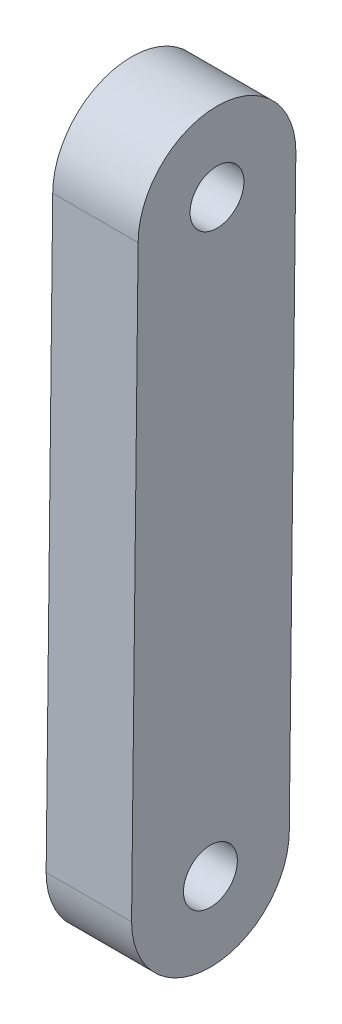
ISO-10303-21;
HEADER;
FILE_DESCRIPTION(('STEP AP214'),'2;1');
FILE_NAME('part.step','',(''),(''),'','','');
FILE_SCHEMA(('AUTOMOTIVE_DESIGN { 1 0 10303 214 1 1 1 1 }'));
ENDSEC;
DATA;
#1=APPLICATION_CONTEXT('core data for automotive mechanical design processes');
#2=APPLICATION_PROTOCOL_DEFINITION('international standard','automotive_design',2000,#1);
#3=PRODUCT_CONTEXT('',#1,'mechanical');
#4=PRODUCT('Part','Part','',(#3));
#5=PRODUCT_RELATED_PRODUCT_CATEGORY('part','',(#4));
#6=PRODUCT_DEFINITION_FORMATION('','',#4);
#7=PRODUCT_DEFINITION_CONTEXT('part definition',#1,'design');
#8=PRODUCT_DEFINITION('design','',#6,#7);
#9=PRODUCT_DEFINITION_SHAPE('','',#8);
#10=(LENGTH_UNIT() NAMED_UNIT(*) SI_UNIT(.MILLI.,.METRE.));
#11=(NAMED_UNIT(*) PLANE_ANGLE_UNIT() SI_UNIT($,.RADIAN.));
#12=(NAMED_UNIT(*) SI_UNIT($,.STERADIAN.) SOLID_ANGLE_UNIT());
#13=UNCERTAINTY_MEASURE_WITH_UNIT(LENGTH_MEASURE(1.E-05),#10,'distance_accuracy_value','');
#14=(GEOMETRIC_REPRESENTATION_CONTEXT(3) GLOBAL_UNCERTAINTY_ASSIGNED_CONTEXT((#13)) GLOBAL_UNIT_ASSIGNED_CONTEXT((#10,
#11,#12)) REPRESENTATION_CONTEXT('',''));
#15=CARTESIAN_POINT('',(0.,0.,0.));
#16=DIRECTION('',(0.,0.,1.));
#17=DIRECTION('',(1.,0.,0.));
#18=AXIS2_PLACEMENT_3D('',#15,#16,#17);
#19=CARTESIAN_POINT('',(49.8662250367172,-181.,23.9999999999999));
#20=DIRECTION('',(-1.,0.,0.));
#21=DIRECTION('',(0.,0.,1.));
#22=AXIS2_PLACEMENT_3D('',#19,#20,#21);
#23=CYLINDRICAL_SURFACE('',#22,6.);
#24=CARTESIAN_POINT('',(-8.,-181.,24.0000000000003));
#25=DIRECTION('',(1.,0.,0.));
#26=DIRECTION('',(0.,0.,-1.));
#27=AXIS2_PLACEMENT_3D('',#24,#25,#26);
#28=CIRCLE('',#27,6.);
#29=CARTESIAN_POINT('',(-8.,-181.,30.0000000000003));
#30=VERTEX_POINT('',#29);
#31=CARTESIAN_POINT('',(-8.,-181.,18.0000000000003));
#32=VERTEX_POINT('',#31);
#33=EDGE_CURVE('E50',#30,#32,#28,.T.);
#34=ORIENTED_EDGE('',*,*,#33,.F.);
#35=DIRECTION('',(-1.,0.,0.));
#36=VECTOR('',#35,1.);
#37=CARTESIAN_POINT('',(49.8662250367172,-181.,29.9999999999999));
#38=LINE('',#37,#36);
#39=CARTESIAN_POINT('',(-14.4999999999997,-181.,30.0000000000004));
#40=VERTEX_POINT('',#39);
#41=EDGE_CURVE('E45',#30,#40,#38,.T.);
#42=ORIENTED_EDGE('',*,*,#41,.T.);
#43=CARTESIAN_POINT('',(-14.4999999999998,-181.,24.0000000000004));
#44=DIRECTION('',(1.,0.,0.));
#45=DIRECTION('',(0.,0.,-1.));
#46=AXIS2_PLACEMENT_3D('',#43,#44,#45);
#47=CIRCLE('',#46,6.);
#48=CARTESIAN_POINT('',(-14.4999999999998,-181.,18.0000000000004));
#49=VERTEX_POINT('',#48);
#50=EDGE_CURVE('E89',#40,#49,#47,.T.);
#51=ORIENTED_EDGE('',*,*,#50,.T.);
#52=DIRECTION('',(-1.,0.,0.));
#53=VECTOR('',#52,1.);
#54=CARTESIAN_POINT('',(49.8662250367171,-181.,17.9999999999999));
#55=LINE('',#54,#53);
#56=EDGE_CURVE('E80',#32,#49,#55,.T.);
#57=ORIENTED_EDGE('',*,*,#56,.F.);
#58=EDGE_LOOP('',(#34,#42,#51,#57));
#59=FACE_BOUND('',#58,.T.);
#60=ADVANCED_FACE('F41',(#59),#23,.T.);
#61=CARTESIAN_POINT('',(49.8662250367171,0.179373895481037,15.9642766978024));
#62=DIRECTION('',(0.,-0.0112352458722889,-0.999936882633193));
#63=DIRECTION('',(0.,0.999936882633194,-0.0112352458722889));
#64=AXIS2_PLACEMENT_3D('',#61,#62,#63);
#65=PLANE('',#64);
#66=DIRECTION('',(-1.,0.,0.));
#67=VECTOR('',#66,1.);
#68=CARTESIAN_POINT('',(49.8662250367171,-136.5,17.4999999999997));
#69=LINE('',#68,#67);
#70=CARTESIAN_POINT('',(-8.,-136.5,17.5000000000001));
#71=VERTEX_POINT('',#70);
#72=CARTESIAN_POINT('',(-14.4999999999998,-136.5,17.5000000000001));
#73=VERTEX_POINT('',#72);
#74=EDGE_CURVE('E120',#71,#73,#69,.T.);
#75=ORIENTED_EDGE('',*,*,#74,.F.);
#76=DIRECTION('',(0.,-0.999936882633194,0.0112352458722889));
#77=VECTOR('',#76,1.);
#78=CARTESIAN_POINT('',(-8.,0.179373895481041,15.9642766978029));
#79=LINE('',#78,#77);
#80=EDGE_CURVE('E86',#71,#32,#79,.T.);
#81=ORIENTED_EDGE('',*,*,#80,.T.);
#82=ORIENTED_EDGE('',*,*,#56,.T.);
#83=DIRECTION('',(0.,-0.999936882633194,0.0112352458722889));
#84=VECTOR('',#83,1.);
#85=CARTESIAN_POINT('',(-14.4999999999999,0.179373895481019,15.9642766978029));
#86=LINE('',#85,#84);
#87=EDGE_CURVE('E102',#73,#49,#86,.T.);
#88=ORIENTED_EDGE('',*,*,#87,.F.);
#89=EDGE_LOOP('',(#75,#81,#82,#88));
#90=FACE_BOUND('',#89,.T.);
#91=ADVANCED_FACE('F140',(#90),#65,.T.);
#92=CARTESIAN_POINT('',(49.8662250367172,-136.5,23.4999999999996));
#93=DIRECTION('',(-1.,0.,0.));
#94=DIRECTION('',(0.,0.,1.));
#95=AXIS2_PLACEMENT_3D('',#92,#93,#94);
#96=CYLINDRICAL_SURFACE('',#95,6.);
#97=CARTESIAN_POINT('',(-8.,-136.5,23.5000000000001));
#98=DIRECTION('',(1.,0.,0.));
#99=DIRECTION('',(0.,0.,-1.));
#100=AXIS2_PLACEMENT_3D('',#97,#98,#99);
#101=CIRCLE('',#100,6.);
#102=CARTESIAN_POINT('',(-8.,-136.5,29.5000000000001));
#103=VERTEX_POINT('',#102);
#104=EDGE_CURVE('E11',#71,#103,#101,.T.);
#105=ORIENTED_EDGE('',*,*,#104,.F.);
#106=ORIENTED_EDGE('',*,*,#74,.T.);
#107=CARTESIAN_POINT('',(-14.4999999999998,-136.5,23.5000000000001));
#108=DIRECTION('',(1.,0.,0.));
#109=DIRECTION('',(0.,0.,-1.));
#110=AXIS2_PLACEMENT_3D('',#107,#108,#109);
#111=CIRCLE('',#110,6.);
#112=CARTESIAN_POINT('',(-14.4999999999998,-136.5,29.5000000000001));
#113=VERTEX_POINT('',#112);
#114=EDGE_CURVE('E115',#73,#113,#111,.T.);
#115=ORIENTED_EDGE('',*,*,#114,.T.);
#116=DIRECTION('',(-1.,0.,0.));
#117=VECTOR('',#116,1.);
#118=CARTESIAN_POINT('',(49.8662250367172,-136.5,29.4999999999996));
#119=LINE('',#118,#117);
#120=EDGE_CURVE('E63',#103,#113,#119,.T.);
#121=ORIENTED_EDGE('',*,*,#120,.F.);
#122=EDGE_LOOP('',(#105,#106,#115,#121));
#123=FACE_BOUND('',#122,.T.);
#124=ADVANCED_FACE('F145',(#123),#96,.T.);
#125=CARTESIAN_POINT('',(49.8662250367172,-136.5,23.4999999999996));
#126=DIRECTION('',(-1.,0.,0.));
#127=DIRECTION('',(0.,0.,1.));
#128=AXIS2_PLACEMENT_3D('',#125,#126,#127);
#129=CYLINDRICAL_SURFACE('',#128,2.05);
#130=CARTESIAN_POINT('',(-14.4999999999998,-136.5,23.5000000000001));
#131=DIRECTION('',(1.,0.,0.));
#132=DIRECTION('',(0.,0.,-1.));
#133=AXIS2_PLACEMENT_3D('',#130,#131,#132);
#134=CIRCLE('',#133,2.05);
#135=CARTESIAN_POINT('',(-14.4999999999998,-136.5,21.4500000000001));
#136=VERTEX_POINT('',#135);
#137=EDGE_CURVE('E112',#136,#136,#134,.T.);
#138=ORIENTED_EDGE('',*,*,#137,.F.);
#139=EDGE_LOOP('',(#138));
#140=FACE_BOUND('',#139,.T.);
#141=CARTESIAN_POINT('',(-8.,-136.5,23.5000000000001));
#142=DIRECTION('',(1.,0.,0.));
#143=DIRECTION('',(0.,0.,-1.));
#144=AXIS2_PLACEMENT_3D('',#141,#142,#143);
#145=CIRCLE('',#144,2.05);
#146=CARTESIAN_POINT('',(-8.,-136.5,21.4500000000001));
#147=VERTEX_POINT('',#146);
#148=EDGE_CURVE('E113',#147,#147,#145,.T.);
#149=ORIENTED_EDGE('',*,*,#148,.T.);
#150=EDGE_LOOP('',(#149));
#151=FACE_BOUND('',#150,.T.);
#152=ADVANCED_FACE('F150',(#140,#151),#129,.F.);
#153=CARTESIAN_POINT('',(49.8662250367172,0.314188336278885,27.9627619288047));
#154=DIRECTION('',(0.,-0.0112352458722889,-0.999936882633193));
#155=DIRECTION('',(0.,0.999936882633194,-0.0112352458722889));
#156=AXIS2_PLACEMENT_3D('',#153,#154,#155);
#157=PLANE('',#156);
#158=DIRECTION('',(0.,-0.999936882633194,0.0112352458722889));
#159=VECTOR('',#158,1.);
#160=CARTESIAN_POINT('',(-8.,0.314188336278889,27.9627619288051));
#161=LINE('',#160,#159);
#162=EDGE_CURVE('E111',#103,#30,#161,.T.);
#163=ORIENTED_EDGE('',*,*,#162,.F.);
#164=ORIENTED_EDGE('',*,*,#120,.T.);
#165=DIRECTION('',(0.,-0.999936882633194,0.0112352458722889));
#166=VECTOR('',#165,1.);
#167=CARTESIAN_POINT('',(-14.4999999999998,0.314188336278867,27.9627619288052));
#168=LINE('',#167,#166);
#169=EDGE_CURVE('E94',#113,#40,#168,.T.);
#170=ORIENTED_EDGE('',*,*,#169,.T.);
#171=ORIENTED_EDGE('',*,*,#41,.F.);
#172=EDGE_LOOP('',(#163,#164,#170,#171));
#173=FACE_BOUND('',#172,.T.);
#174=ADVANCED_FACE('F95',(#173),#157,.F.);
#175=CARTESIAN_POINT('',(49.8662250367172,-181.,23.9999999999999));
#176=DIRECTION('',(-1.,0.,0.));
#177=DIRECTION('',(0.,0.,1.));
#178=AXIS2_PLACEMENT_3D('',#175,#176,#177);
#179=CYLINDRICAL_SURFACE('',#178,2.05);
#180=CARTESIAN_POINT('',(-14.4999999999998,-181.,24.0000000000004));
#181=DIRECTION('',(1.,0.,0.));
#182=DIRECTION('',(0.,0.,-1.));
#183=AXIS2_PLACEMENT_3D('',#180,#181,#182);
#184=CIRCLE('',#183,2.05);
#185=CARTESIAN_POINT('',(-14.4999999999998,-181.,21.9500000000004));
#186=VERTEX_POINT('',#185);
#187=EDGE_CURVE('E98',#186,#186,#184,.F.);
#188=ORIENTED_EDGE('',*,*,#187,.T.);
#189=EDGE_LOOP('',(#188));
#190=FACE_BOUND('',#189,.T.);
#191=CARTESIAN_POINT('',(-8.,-181.,24.0000000000003));
#192=DIRECTION('',(1.,0.,0.));
#193=DIRECTION('',(0.,0.,-1.));
#194=AXIS2_PLACEMENT_3D('',#191,#192,#193);
#195=CIRCLE('',#194,2.05);
#196=CARTESIAN_POINT('',(-8.,-181.,21.9500000000003));
#197=VERTEX_POINT('',#196);
#198=EDGE_CURVE('E108',#197,#197,#195,.F.);
#199=ORIENTED_EDGE('',*,*,#198,.F.);
#200=EDGE_LOOP('',(#199));
#201=FACE_BOUND('',#200,.T.);
#202=ADVANCED_FACE('F128',(#190,#201),#179,.F.);
#203=CARTESIAN_POINT('',(-14.5,0.,1.02288137189082E-13));
#204=DIRECTION('',(1.,0.,0.));
#205=DIRECTION('',(0.,0.,-1.));
#206=AXIS2_PLACEMENT_3D('',#203,#204,#205);
#207=PLANE('',#206);
#208=ORIENTED_EDGE('',*,*,#50,.F.);
#209=ORIENTED_EDGE('',*,*,#169,.F.);
#210=ORIENTED_EDGE('',*,*,#114,.F.);
#211=ORIENTED_EDGE('',*,*,#87,.T.);
#212=EDGE_LOOP('',(#208,#209,#210,#211));
#213=FACE_BOUND('',#212,.T.);
#214=ORIENTED_EDGE('',*,*,#137,.T.);
#215=EDGE_LOOP('',(#214));
#216=FACE_BOUND('',#215,.T.);
#217=ORIENTED_EDGE('',*,*,#187,.F.);
#218=EDGE_LOOP('',(#217));
#219=FACE_BOUND('',#218,.T.);
#220=ADVANCED_FACE('F100',(#213,#216,#219),#207,.F.);
#221=CARTESIAN_POINT('',(-8.,0.,0.));
#222=DIRECTION('',(1.,0.,0.));
#223=DIRECTION('',(0.,0.,-1.));
#224=AXIS2_PLACEMENT_3D('',#221,#222,#223);
#225=PLANE('',#224);
#226=ORIENTED_EDGE('',*,*,#148,.F.);
#227=EDGE_LOOP('',(#226));
#228=FACE_BOUND('',#227,.T.);
#229=ORIENTED_EDGE('',*,*,#198,.T.);
#230=EDGE_LOOP('',(#229));
#231=FACE_BOUND('',#230,.T.);
#232=ORIENTED_EDGE('',*,*,#162,.T.);
#233=ORIENTED_EDGE('',*,*,#33,.T.);
#234=ORIENTED_EDGE('',*,*,#80,.F.);
#235=ORIENTED_EDGE('',*,*,#104,.T.);
#236=EDGE_LOOP('',(#232,#233,#234,#235));
#237=FACE_BOUND('',#236,.T.);
#238=ADVANCED_FACE('F43',(#228,#231,#237),#225,.T.);
#239=CLOSED_SHELL('',(#60,#91,#124,#152,#174,#202,#220,#238));
#240=MANIFOLD_SOLID_BREP('B2',#239);
#241=ADVANCED_BREP_SHAPE_REPRESENTATION('',(#18,#240),#14);
#242=SHAPE_DEFINITION_REPRESENTATION(#9,#241);
ENDSEC;
END-ISO-10303-21;
